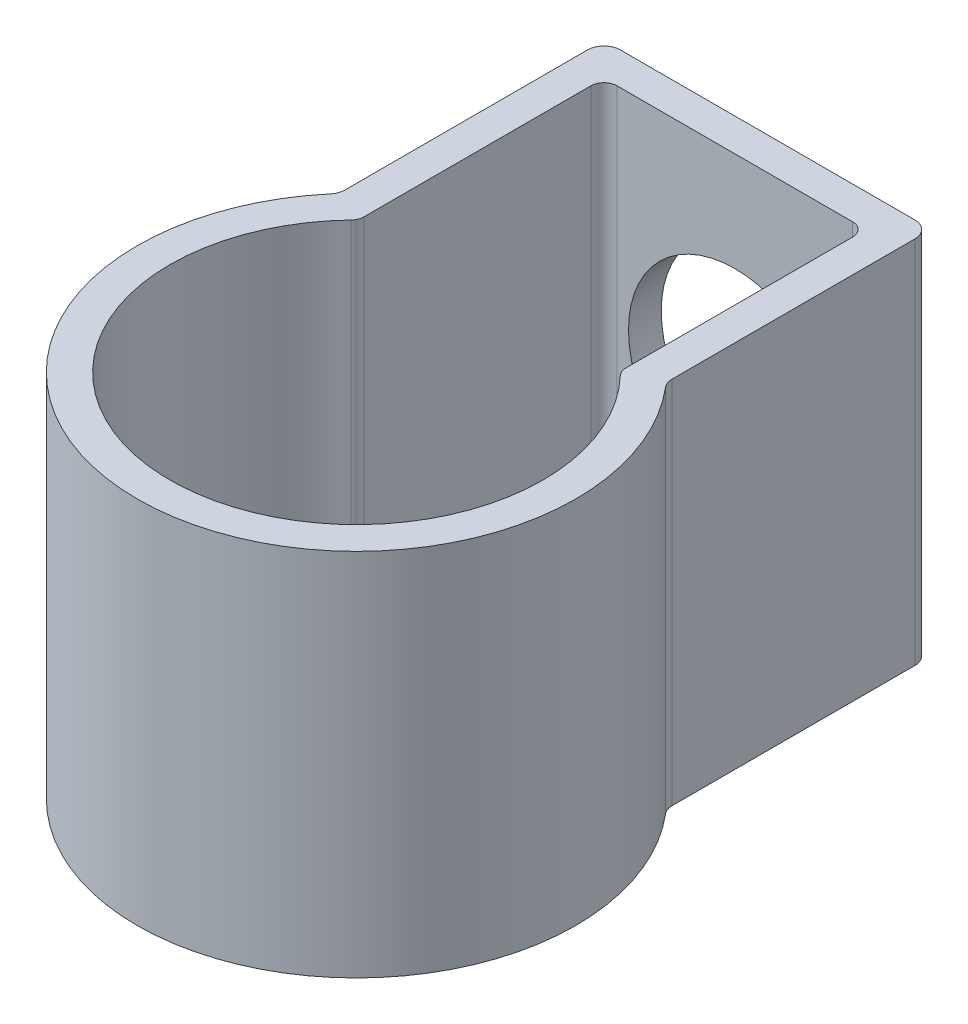
ISO-10303-21;
HEADER;
FILE_DESCRIPTION(('STEP AP214'),'2;1');
FILE_NAME('part.step','',(''),(''),'','','');
FILE_SCHEMA(('AUTOMOTIVE_DESIGN { 1 0 10303 214 1 1 1 1 }'));
ENDSEC;
DATA;
#1=APPLICATION_CONTEXT('core data for automotive mechanical design processes');
#2=APPLICATION_PROTOCOL_DEFINITION('international standard','automotive_design',2000,#1);
#3=PRODUCT_CONTEXT('',#1,'mechanical');
#4=PRODUCT('Part','Part','',(#3));
#5=PRODUCT_RELATED_PRODUCT_CATEGORY('part','',(#4));
#6=PRODUCT_DEFINITION_FORMATION('','',#4);
#7=PRODUCT_DEFINITION_CONTEXT('part definition',#1,'design');
#8=PRODUCT_DEFINITION('design','',#6,#7);
#9=PRODUCT_DEFINITION_SHAPE('','',#8);
#10=(LENGTH_UNIT() NAMED_UNIT(*) SI_UNIT(.MILLI.,.METRE.));
#11=(NAMED_UNIT(*) PLANE_ANGLE_UNIT() SI_UNIT($,.RADIAN.));
#12=(NAMED_UNIT(*) SI_UNIT($,.STERADIAN.) SOLID_ANGLE_UNIT());
#13=UNCERTAINTY_MEASURE_WITH_UNIT(LENGTH_MEASURE(1.E-05),#10,'distance_accuracy_value','');
#14=(GEOMETRIC_REPRESENTATION_CONTEXT(3) GLOBAL_UNCERTAINTY_ASSIGNED_CONTEXT((#13)) GLOBAL_UNIT_ASSIGNED_CONTEXT((#10,
#11,#12)) REPRESENTATION_CONTEXT('',''));
#15=CARTESIAN_POINT('',(0.,0.,0.));
#16=DIRECTION('',(0.,0.,1.));
#17=DIRECTION('',(1.,0.,0.));
#18=AXIS2_PLACEMENT_3D('',#15,#16,#17);
#19=CARTESIAN_POINT('',(10.,20.574,-25.1215762016988));
#20=DIRECTION('',(0.,0.,1.));
#21=DIRECTION('',(1.,0.,0.));
#22=AXIS2_PLACEMENT_3D('',#19,#20,#21);
#23=PLANE('',#22);
#24=CARTESIAN_POINT('',(0.,8.,-25.1215762016988));
#25=DIRECTION('',(0.,0.,1.));
#26=DIRECTION('',(1.,0.,0.));
#27=AXIS2_PLACEMENT_3D('',#24,#25,#26);
#28=CIRCLE('',#27,6.5);
#29=CARTESIAN_POINT('',(6.5,8.,-25.1215762016988));
#30=VERTEX_POINT('',#29);
#31=EDGE_CURVE('E245',#30,#30,#28,.T.);
#32=ORIENTED_EDGE('',*,*,#31,.T.);
#33=EDGE_LOOP('',(#32));
#34=FACE_BOUND('',#33,.T.);
#35=DIRECTION('',(1.,0.,0.));
#36=VECTOR('',#35,1.);
#37=CARTESIAN_POINT('',(-3.,-1.5,-25.1215762016988));
#38=LINE('',#37,#36);
#39=CARTESIAN_POINT('',(-3.20000000000001,-1.5,-25.1215762016988));
#40=VERTEX_POINT('',#39);
#41=CARTESIAN_POINT('',(3.19999999999999,-1.5,-25.1215762016988));
#42=VERTEX_POINT('',#41);
#43=EDGE_CURVE('E344',#40,#42,#38,.T.);
#44=ORIENTED_EDGE('',*,*,#43,.F.);
#45=DIRECTION('',(0.,1.,0.));
#46=VECTOR('',#45,1.);
#47=CARTESIAN_POINT('',(-3.2,-2.,-25.1215762016988));
#48=LINE('',#47,#46);
#49=CARTESIAN_POINT('',(-3.20000000000001,-2.,-25.1215762016988));
#50=VERTEX_POINT('',#49);
#51=EDGE_CURVE('E303',#40,#50,#48,.F.);
#52=ORIENTED_EDGE('',*,*,#51,.T.);
#53=DIRECTION('',(1.,0.,0.));
#54=VECTOR('',#53,1.);
#55=CARTESIAN_POINT('',(10.,-2.,-25.1215762016988));
#56=LINE('',#55,#54);
#57=CARTESIAN_POINT('',(-9.,-2.,-25.1215762016988));
#58=VERTEX_POINT('',#57);
#59=EDGE_CURVE('E531',#58,#50,#56,.T.);
#60=ORIENTED_EDGE('',*,*,#59,.F.);
#61=DIRECTION('',(0.,-1.,0.));
#62=VECTOR('',#61,1.);
#63=CARTESIAN_POINT('',(-9.,20.574,-25.1215762016988));
#64=LINE('',#63,#62);
#65=CARTESIAN_POINT('',(-9.,20.574,-25.1215762016988));
#66=VERTEX_POINT('',#65);
#67=EDGE_CURVE('E277',#58,#66,#64,.F.);
#68=ORIENTED_EDGE('',*,*,#67,.T.);
#69=DIRECTION('',(-1.,0.,0.));
#70=VECTOR('',#69,1.);
#71=CARTESIAN_POINT('',(10.,20.574,-25.1215762016988));
#72=LINE('',#71,#70);
#73=CARTESIAN_POINT('',(9.,20.574,-25.1215762016988));
#74=VERTEX_POINT('',#73);
#75=EDGE_CURVE('E257',#74,#66,#72,.T.);
#76=ORIENTED_EDGE('',*,*,#75,.F.);
#77=DIRECTION('',(0.,-1.,0.));
#78=VECTOR('',#77,1.);
#79=CARTESIAN_POINT('',(9.,20.574,-25.1215762016988));
#80=LINE('',#79,#78);
#81=CARTESIAN_POINT('',(9.,-2.,-25.1215762016988));
#82=VERTEX_POINT('',#81);
#83=EDGE_CURVE('E273',#74,#82,#80,.T.);
#84=ORIENTED_EDGE('',*,*,#83,.T.);
#85=CARTESIAN_POINT('',(3.2,-2.,-25.1215762016988));
#86=VERTEX_POINT('',#85);
#87=EDGE_CURVE('E528',#86,#82,#56,.T.);
#88=ORIENTED_EDGE('',*,*,#87,.F.);
#89=DIRECTION('',(0.,-1.,0.));
#90=VECTOR('',#89,1.);
#91=CARTESIAN_POINT('',(3.2,-1.5,-25.1215762016988));
#92=LINE('',#91,#90);
#93=EDGE_CURVE('E299',#86,#42,#92,.F.);
#94=ORIENTED_EDGE('',*,*,#93,.T.);
#95=EDGE_LOOP('',(#44,#52,#60,#68,#76,#84,#88,#94));
#96=FACE_BOUND('',#95,.T.);
#97=ADVANCED_FACE('F44',(#34,#96),#23,.F.);
#98=CARTESIAN_POINT('',(0.,20.574,0.));
#99=DIRECTION('',(0.,1.,0.));
#100=DIRECTION('',(0.,0.,1.));
#101=AXIS2_PLACEMENT_3D('',#98,#99,#100);
#102=PLANE('',#101);
#103=ORIENTED_EDGE('',*,*,#75,.T.);
#104=CARTESIAN_POINT('',(-9.,20.574,-24.1215762016988));
#105=DIRECTION('',(0.,1.,0.));
#106=DIRECTION('',(0.,0.,1.));
#107=AXIS2_PLACEMENT_3D('',#104,#105,#106);
#108=CIRCLE('',#107,1.);
#109=CARTESIAN_POINT('',(-10.,20.574,-24.1215762016988));
#110=VERTEX_POINT('',#109);
#111=EDGE_CURVE('E283',#66,#110,#108,.T.);
#112=ORIENTED_EDGE('',*,*,#111,.T.);
#113=DIRECTION('',(0.,0.,1.));
#114=VECTOR('',#113,1.);
#115=CARTESIAN_POINT('',(-10.,20.574,-25.1215762016988));
#116=LINE('',#115,#114);
#117=CARTESIAN_POINT('',(-10.,20.574,-9.29300812439122));
#118=VERTEX_POINT('',#117);
#119=EDGE_CURVE('E250',#110,#118,#116,.T.);
#120=ORIENTED_EDGE('',*,*,#119,.T.);
#121=CARTESIAN_POINT('',(-11.,20.574,-9.29300812439122));
#122=DIRECTION('',(0.,1.,0.));
#123=DIRECTION('',(0.,0.,1.));
#124=AXIS2_PLACEMENT_3D('',#121,#122,#123);
#125=CIRCLE('',#124,1.);
#126=CARTESIAN_POINT('',(-10.2361111111111,20.574,-8.64766033797517));
#127=VERTEX_POINT('',#126);
#128=EDGE_CURVE('E233',#118,#127,#125,.F.);
#129=ORIENTED_EDGE('',*,*,#128,.T.);
#130=CARTESIAN_POINT('',(0.,20.574,0.));
#131=DIRECTION('',(0.,1.,0.));
#132=DIRECTION('',(0.,0.,1.));
#133=AXIS2_PLACEMENT_3D('',#130,#131,#132);
#134=CIRCLE('',#133,13.4);
#135=CARTESIAN_POINT('',(10.2361111111111,20.574,-8.64766033797516));
#136=VERTEX_POINT('',#135);
#137=EDGE_CURVE('E502',#127,#136,#134,.T.);
#138=ORIENTED_EDGE('',*,*,#137,.T.);
#139=CARTESIAN_POINT('',(11.,20.574,-9.29300812439122));
#140=DIRECTION('',(0.,1.,0.));
#141=DIRECTION('',(0.,0.,1.));
#142=AXIS2_PLACEMENT_3D('',#139,#140,#141);
#143=CIRCLE('',#142,1.);
#144=CARTESIAN_POINT('',(10.,20.574,-9.29300812439122));
#145=VERTEX_POINT('',#144);
#146=EDGE_CURVE('E232',#136,#145,#143,.F.);
#147=ORIENTED_EDGE('',*,*,#146,.T.);
#148=DIRECTION('',(0.,0.,-1.));
#149=VECTOR('',#148,1.);
#150=CARTESIAN_POINT('',(10.,20.574,-8.91964124839117));
#151=LINE('',#150,#149);
#152=CARTESIAN_POINT('',(10.,20.574,-24.1215762016988));
#153=VERTEX_POINT('',#152);
#154=EDGE_CURVE('E505',#145,#153,#151,.T.);
#155=ORIENTED_EDGE('',*,*,#154,.T.);
#156=CARTESIAN_POINT('',(9.,20.574,-24.1215762016988));
#157=DIRECTION('',(0.,1.,0.));
#158=DIRECTION('',(0.,0.,1.));
#159=AXIS2_PLACEMENT_3D('',#156,#157,#158);
#160=CIRCLE('',#159,1.);
#161=EDGE_CURVE('E280',#153,#74,#160,.T.);
#162=ORIENTED_EDGE('',*,*,#161,.T.);
#163=EDGE_LOOP('',(#103,#112,#120,#129,#138,#147,#155,#162));
#164=FACE_BOUND('',#163,.T.);
#165=DIRECTION('',(0.,0.,-1.));
#166=VECTOR('',#165,1.);
#167=CARTESIAN_POINT('',(8.,20.574,-8.12157620169878));
#168=LINE('',#167,#166);
#169=CARTESIAN_POINT('',(8.,20.574,-8.44985206971104));
#170=VERTEX_POINT('',#169);
#171=CARTESIAN_POINT('',(8.,20.574,-22.3215762016988));
#172=VERTEX_POINT('',#171);
#173=EDGE_CURVE('E493',#170,#172,#168,.T.);
#174=ORIENTED_EDGE('',*,*,#173,.F.);
#175=CARTESIAN_POINT('',(8.8,20.574,-8.44985206971104));
#176=DIRECTION('',(0.,1.,0.));
#177=DIRECTION('',(0.,0.,1.));
#178=AXIS2_PLACEMENT_3D('',#175,#176,#177);
#179=CIRCLE('',#178,0.8);
#180=CARTESIAN_POINT('',(8.22295081967213,20.574,-7.89576340940212));
#181=VERTEX_POINT('',#180);
#182=EDGE_CURVE('E378',#170,#181,#179,.T.);
#183=ORIENTED_EDGE('',*,*,#182,.T.);
#184=CARTESIAN_POINT('',(0.,20.574,0.));
#185=DIRECTION('',(0.,1.,0.));
#186=DIRECTION('',(0.,0.,1.));
#187=AXIS2_PLACEMENT_3D('',#184,#185,#186);
#188=CIRCLE('',#187,11.4);
#189=CARTESIAN_POINT('',(-8.22295081967213,20.574,-7.89576340940212));
#190=VERTEX_POINT('',#189);
#191=EDGE_CURVE('E485',#190,#181,#188,.T.);
#192=ORIENTED_EDGE('',*,*,#191,.F.);
#193=CARTESIAN_POINT('',(-8.8,20.574,-8.44985206971104));
#194=DIRECTION('',(0.,1.,0.));
#195=DIRECTION('',(0.,0.,1.));
#196=AXIS2_PLACEMENT_3D('',#193,#194,#195);
#197=CIRCLE('',#196,0.8);
#198=CARTESIAN_POINT('',(-8.,20.574,-8.44985206971104));
#199=VERTEX_POINT('',#198);
#200=EDGE_CURVE('E375',#190,#199,#197,.T.);
#201=ORIENTED_EDGE('',*,*,#200,.T.);
#202=DIRECTION('',(0.,0.,1.));
#203=VECTOR('',#202,1.);
#204=CARTESIAN_POINT('',(-8.,20.574,-23.1215762016988));
#205=LINE('',#204,#203);
#206=CARTESIAN_POINT('',(-8.,20.574,-22.3215762016988));
#207=VERTEX_POINT('',#206);
#208=EDGE_CURVE('E483',#207,#199,#205,.T.);
#209=ORIENTED_EDGE('',*,*,#208,.F.);
#210=CARTESIAN_POINT('',(-7.2,20.574,-22.3215762016988));
#211=DIRECTION('',(0.,1.,0.));
#212=DIRECTION('',(0.,0.,1.));
#213=AXIS2_PLACEMENT_3D('',#210,#211,#212);
#214=CIRCLE('',#213,0.8);
#215=CARTESIAN_POINT('',(-7.2,20.574,-23.1215762016988));
#216=VERTEX_POINT('',#215);
#217=EDGE_CURVE('E384',#207,#216,#214,.F.);
#218=ORIENTED_EDGE('',*,*,#217,.T.);
#219=DIRECTION('',(-1.,0.,0.));
#220=VECTOR('',#219,1.);
#221=CARTESIAN_POINT('',(8.,20.574,-23.1215762016988));
#222=LINE('',#221,#220);
#223=CARTESIAN_POINT('',(7.2,20.574,-23.1215762016988));
#224=VERTEX_POINT('',#223);
#225=EDGE_CURVE('E489',#224,#216,#222,.T.);
#226=ORIENTED_EDGE('',*,*,#225,.F.);
#227=CARTESIAN_POINT('',(7.2,20.574,-22.3215762016988));
#228=DIRECTION('',(0.,1.,0.));
#229=DIRECTION('',(0.,0.,1.));
#230=AXIS2_PLACEMENT_3D('',#227,#228,#229);
#231=CIRCLE('',#230,0.8);
#232=EDGE_CURVE('E381',#224,#172,#231,.F.);
#233=ORIENTED_EDGE('',*,*,#232,.T.);
#234=EDGE_LOOP('',(#174,#183,#192,#201,#209,#218,#226,#233));
#235=FACE_BOUND('',#234,.T.);
#236=ADVANCED_FACE('F482',(#164,#235),#102,.T.);
#237=CARTESIAN_POINT('',(0.,20.574,0.));
#238=DIRECTION('',(0.,-1.,0.));
#239=DIRECTION('',(0.,0.,-1.));
#240=AXIS2_PLACEMENT_3D('',#237,#238,#239);
#241=CYLINDRICAL_SURFACE('',#240,13.4);
#242=ORIENTED_EDGE('',*,*,#137,.F.);
#243=DIRECTION('',(0.,-1.,0.));
#244=VECTOR('',#243,1.);
#245=CARTESIAN_POINT('',(-10.2361111111111,20.574,-8.64766033797517));
#246=LINE('',#245,#244);
#247=CARTESIAN_POINT('',(-10.2361111111111,-2.,-8.64766033797517));
#248=VERTEX_POINT('',#247);
#249=EDGE_CURVE('E242',#127,#248,#246,.T.);
#250=ORIENTED_EDGE('',*,*,#249,.T.);
#251=CARTESIAN_POINT('',(0.,-2.,0.));
#252=DIRECTION('',(0.,-1.,0.));
#253=DIRECTION('',(0.,0.,-1.));
#254=AXIS2_PLACEMENT_3D('',#251,#252,#253);
#255=CIRCLE('',#254,13.4);
#256=CARTESIAN_POINT('',(10.2361111111111,-2.,-8.64766033797516));
#257=VERTEX_POINT('',#256);
#258=EDGE_CURVE('E224',#257,#248,#255,.T.);
#259=ORIENTED_EDGE('',*,*,#258,.F.);
#260=DIRECTION('',(0.,-1.,0.));
#261=VECTOR('',#260,1.);
#262=CARTESIAN_POINT('',(10.2361111111111,20.574,-8.64766033797516));
#263=LINE('',#262,#261);
#264=EDGE_CURVE('E239',#257,#136,#263,.F.);
#265=ORIENTED_EDGE('',*,*,#264,.T.);
#266=EDGE_LOOP('',(#242,#250,#259,#265));
#267=FACE_BOUND('',#266,.T.);
#268=ADVANCED_FACE('F238',(#267),#241,.T.);
#269=CARTESIAN_POINT('',(10.,20.574,-8.91964124839117));
#270=DIRECTION('',(-1.,0.,0.));
#271=DIRECTION('',(0.,0.,1.));
#272=AXIS2_PLACEMENT_3D('',#269,#270,#271);
#273=PLANE('',#272);
#274=DIRECTION('',(0.,0.,1.));
#275=VECTOR('',#274,1.);
#276=CARTESIAN_POINT('',(10.,-2.,-8.91964124839117));
#277=LINE('',#276,#275);
#278=CARTESIAN_POINT('',(10.,-2.,-24.1215762016988));
#279=VERTEX_POINT('',#278);
#280=CARTESIAN_POINT('',(10.,-2.,-9.29300812439122));
#281=VERTEX_POINT('',#280);
#282=EDGE_CURVE('E226',#279,#281,#277,.T.);
#283=ORIENTED_EDGE('',*,*,#282,.F.);
#284=DIRECTION('',(0.,-1.,0.));
#285=VECTOR('',#284,1.);
#286=CARTESIAN_POINT('',(10.,20.574,-24.1215762016988));
#287=LINE('',#286,#285);
#288=EDGE_CURVE('E289',#279,#153,#287,.F.);
#289=ORIENTED_EDGE('',*,*,#288,.T.);
#290=ORIENTED_EDGE('',*,*,#154,.F.);
#291=DIRECTION('',(0.,1.,0.));
#292=VECTOR('',#291,1.);
#293=CARTESIAN_POINT('',(10.,-2.,-9.29300812439122));
#294=LINE('',#293,#292);
#295=EDGE_CURVE('E286',#145,#281,#294,.F.);
#296=ORIENTED_EDGE('',*,*,#295,.T.);
#297=EDGE_LOOP('',(#283,#289,#290,#296));
#298=FACE_BOUND('',#297,.T.);
#299=ADVANCED_FACE('F636',(#298),#273,.F.);
#300=CARTESIAN_POINT('',(-10.,20.574,-25.1215762016988));
#301=DIRECTION('',(1.,0.,0.));
#302=DIRECTION('',(0.,0.,-1.));
#303=AXIS2_PLACEMENT_3D('',#300,#301,#302);
#304=PLANE('',#303);
#305=DIRECTION('',(0.,0.,-1.));
#306=VECTOR('',#305,1.);
#307=CARTESIAN_POINT('',(-10.,-2.,-25.1215762016988));
#308=LINE('',#307,#306);
#309=CARTESIAN_POINT('',(-10.,-2.,-9.29300812439122));
#310=VERTEX_POINT('',#309);
#311=CARTESIAN_POINT('',(-10.,-2.,-24.1215762016988));
#312=VERTEX_POINT('',#311);
#313=EDGE_CURVE('E244',#310,#312,#308,.T.);
#314=ORIENTED_EDGE('',*,*,#313,.F.);
#315=DIRECTION('',(0.,1.,0.));
#316=VECTOR('',#315,1.);
#317=CARTESIAN_POINT('',(-10.,20.574,-9.29300812439122));
#318=LINE('',#317,#316);
#319=EDGE_CURVE('E264',#310,#118,#318,.T.);
#320=ORIENTED_EDGE('',*,*,#319,.T.);
#321=ORIENTED_EDGE('',*,*,#119,.F.);
#322=DIRECTION('',(0.,-1.,0.));
#323=VECTOR('',#322,1.);
#324=CARTESIAN_POINT('',(-10.,20.574,-24.1215762016988));
#325=LINE('',#324,#323);
#326=EDGE_CURVE('E254',#110,#312,#325,.T.);
#327=ORIENTED_EDGE('',*,*,#326,.T.);
#328=EDGE_LOOP('',(#314,#320,#321,#327));
#329=FACE_BOUND('',#328,.T.);
#330=ADVANCED_FACE('F524',(#329),#304,.F.);
#331=CARTESIAN_POINT('',(8.,20.574,-23.1215762016988));
#332=DIRECTION('',(0.,0.,1.));
#333=DIRECTION('',(1.,0.,0.));
#334=AXIS2_PLACEMENT_3D('',#331,#332,#333);
#335=PLANE('',#334);
#336=CARTESIAN_POINT('',(0.,8.,-23.1215762016988));
#337=DIRECTION('',(0.,0.,1.));
#338=DIRECTION('',(1.,0.,0.));
#339=AXIS2_PLACEMENT_3D('',#336,#337,#338);
#340=CIRCLE('',#339,6.5);
#341=CARTESIAN_POINT('',(6.5,8.,-23.1215762016988));
#342=VERTEX_POINT('',#341);
#343=EDGE_CURVE('E555',#342,#342,#340,.T.);
#344=ORIENTED_EDGE('',*,*,#343,.F.);
#345=EDGE_LOOP('',(#344));
#346=FACE_BOUND('',#345,.T.);
#347=DIRECTION('',(0.,-1.,0.));
#348=VECTOR('',#347,1.);
#349=CARTESIAN_POINT('',(-7.2,0.,-23.1215762016988));
#350=LINE('',#349,#348);
#351=CARTESIAN_POINT('',(-7.2,0.199999999999999,-23.1215762016988));
#352=VERTEX_POINT('',#351);
#353=EDGE_CURVE('E355',#216,#352,#350,.T.);
#354=ORIENTED_EDGE('',*,*,#353,.T.);
#355=DIRECTION('',(1.,0.,0.));
#356=VECTOR('',#355,1.);
#357=CARTESIAN_POINT('',(8.,0.199999999999999,-23.1215762016988));
#358=LINE('',#357,#356);
#359=CARTESIAN_POINT('',(7.2,0.199999999999999,-23.1215762016988));
#360=VERTEX_POINT('',#359);
#361=EDGE_CURVE('E412',#352,#360,#358,.T.);
#362=ORIENTED_EDGE('',*,*,#361,.T.);
#363=DIRECTION('',(0.,-1.,0.));
#364=VECTOR('',#363,1.);
#365=CARTESIAN_POINT('',(7.2,20.574,-23.1215762016988));
#366=LINE('',#365,#364);
#367=EDGE_CURVE('E359',#360,#224,#366,.F.);
#368=ORIENTED_EDGE('',*,*,#367,.T.);
#369=ORIENTED_EDGE('',*,*,#225,.T.);
#370=EDGE_LOOP('',(#354,#362,#368,#369));
#371=FACE_BOUND('',#370,.T.);
#372=ADVANCED_FACE('F577',(#346,#371),#335,.T.);
#373=CARTESIAN_POINT('',(-8.,20.574,-23.1215762016988));
#374=DIRECTION('',(1.,0.,0.));
#375=DIRECTION('',(0.,0.,-1.));
#376=AXIS2_PLACEMENT_3D('',#373,#374,#375);
#377=PLANE('',#376);
#378=DIRECTION('',(0.,-1.,0.));
#379=VECTOR('',#378,1.);
#380=CARTESIAN_POINT('',(-8.,20.574,-8.44985206971104));
#381=LINE('',#380,#379);
#382=CARTESIAN_POINT('',(-8.,0.199999999999999,-8.44985206971104));
#383=VERTEX_POINT('',#382);
#384=EDGE_CURVE('E362',#199,#383,#381,.T.);
#385=ORIENTED_EDGE('',*,*,#384,.T.);
#386=DIRECTION('',(0.,0.,-1.));
#387=VECTOR('',#386,1.);
#388=CARTESIAN_POINT('',(-8.,0.199999999999999,-23.1215762016988));
#389=LINE('',#388,#387);
#390=CARTESIAN_POINT('',(-8.,0.199999999999999,-22.3215762016988));
#391=VERTEX_POINT('',#390);
#392=EDGE_CURVE('E11',#383,#391,#389,.T.);
#393=ORIENTED_EDGE('',*,*,#392,.T.);
#394=DIRECTION('',(0.,-1.,0.));
#395=VECTOR('',#394,1.);
#396=CARTESIAN_POINT('',(-8.,20.574,-22.3215762016988));
#397=LINE('',#396,#395);
#398=EDGE_CURVE('E365',#391,#207,#397,.F.);
#399=ORIENTED_EDGE('',*,*,#398,.T.);
#400=ORIENTED_EDGE('',*,*,#208,.T.);
#401=EDGE_LOOP('',(#385,#393,#399,#400));
#402=FACE_BOUND('',#401,.T.);
#403=ADVANCED_FACE('F486',(#402),#377,.T.);
#404=CARTESIAN_POINT('',(0.,20.574,0.));
#405=DIRECTION('',(0.,-1.,0.));
#406=DIRECTION('',(0.,0.,-1.));
#407=AXIS2_PLACEMENT_3D('',#404,#405,#406);
#408=CYLINDRICAL_SURFACE('',#407,11.4);
#409=DIRECTION('',(0.,-1.,0.));
#410=VECTOR('',#409,1.);
#411=CARTESIAN_POINT('',(8.22295081967213,20.574,-7.89576340940212));
#412=LINE('',#411,#410);
#413=CARTESIAN_POINT('',(8.22295081967213,0.199999999999999,-7.89576340940212));
#414=VERTEX_POINT('',#413);
#415=EDGE_CURVE('E371',#181,#414,#412,.T.);
#416=ORIENTED_EDGE('',*,*,#415,.T.);
#417=CARTESIAN_POINT('',(0.,0.200000000000009,0.));
#418=DIRECTION('',(0.,-1.,0.));
#419=DIRECTION('',(0.,0.,-1.));
#420=AXIS2_PLACEMENT_3D('',#417,#418,#419);
#421=CIRCLE('',#420,11.4);
#422=CARTESIAN_POINT('',(-8.22295081967213,0.199999999999999,-7.89576340940212));
#423=VERTEX_POINT('',#422);
#424=EDGE_CURVE('E419',#414,#423,#421,.T.);
#425=ORIENTED_EDGE('',*,*,#424,.T.);
#426=DIRECTION('',(0.,-1.,0.));
#427=VECTOR('',#426,1.);
#428=CARTESIAN_POINT('',(-8.22295081967213,20.574,-7.89576340940212));
#429=LINE('',#428,#427);
#430=EDGE_CURVE('E368',#423,#190,#429,.F.);
#431=ORIENTED_EDGE('',*,*,#430,.T.);
#432=ORIENTED_EDGE('',*,*,#191,.T.);
#433=EDGE_LOOP('',(#416,#425,#431,#432));
#434=FACE_BOUND('',#433,.T.);
#435=ADVANCED_FACE('F472',(#434),#408,.F.);
#436=CARTESIAN_POINT('',(8.,20.574,-8.12157620169878));
#437=DIRECTION('',(-1.,0.,0.));
#438=DIRECTION('',(0.,0.,1.));
#439=AXIS2_PLACEMENT_3D('',#436,#437,#438);
#440=PLANE('',#439);
#441=DIRECTION('',(0.,-1.,0.));
#442=VECTOR('',#441,1.);
#443=CARTESIAN_POINT('',(8.,0.,-22.3215762016988));
#444=LINE('',#443,#442);
#445=CARTESIAN_POINT('',(8.,0.199999999999999,-22.3215762016988));
#446=VERTEX_POINT('',#445);
#447=EDGE_CURVE('E351',#172,#446,#444,.T.);
#448=ORIENTED_EDGE('',*,*,#447,.T.);
#449=DIRECTION('',(0.,0.,1.));
#450=VECTOR('',#449,1.);
#451=CARTESIAN_POINT('',(8.,0.199999999999999,-8.12157620169878));
#452=LINE('',#451,#450);
#453=CARTESIAN_POINT('',(8.,0.199999999999999,-8.44985206971104));
#454=VERTEX_POINT('',#453);
#455=EDGE_CURVE('E416',#446,#454,#452,.T.);
#456=ORIENTED_EDGE('',*,*,#455,.T.);
#457=DIRECTION('',(0.,-1.,0.));
#458=VECTOR('',#457,1.);
#459=CARTESIAN_POINT('',(8.,20.574,-8.44985206971104));
#460=LINE('',#459,#458);
#461=EDGE_CURVE('E339',#454,#170,#460,.F.);
#462=ORIENTED_EDGE('',*,*,#461,.T.);
#463=ORIENTED_EDGE('',*,*,#173,.T.);
#464=EDGE_LOOP('',(#448,#456,#462,#463));
#465=FACE_BOUND('',#464,.T.);
#466=ADVANCED_FACE('F611',(#465),#440,.T.);
#467=CARTESIAN_POINT('',(0.,0.,0.));
#468=DIRECTION('',(0.,-1.,0.));
#469=DIRECTION('',(0.,0.,-1.));
#470=AXIS2_PLACEMENT_3D('',#467,#468,#469);
#471=PLANE('',#470);
#472=CARTESIAN_POINT('',(8.8,0.,-8.44985206971104));
#473=DIRECTION('',(0.,-1.,0.));
#474=DIRECTION('',(0.,0.,-1.));
#475=AXIS2_PLACEMENT_3D('',#472,#473,#474);
#476=CIRCLE('',#475,1.00000000000001);
#477=CARTESIAN_POINT('',(8.07868852459015,0.,-7.75724124432488));
#478=VERTEX_POINT('',#477);
#479=CARTESIAN_POINT('',(7.79999999999999,0.,-8.44985206971104));
#480=VERTEX_POINT('',#479);
#481=EDGE_CURVE('E403',#478,#480,#476,.T.);
#482=ORIENTED_EDGE('',*,*,#481,.T.);
#483=DIRECTION('',(0.,0.,-1.));
#484=VECTOR('',#483,1.);
#485=CARTESIAN_POINT('',(7.79999999999999,0.,0.));
#486=LINE('',#485,#484);
#487=CARTESIAN_POINT('',(7.79999999999999,0.,-22.3215762016988));
#488=VERTEX_POINT('',#487);
#489=EDGE_CURVE('E409',#480,#488,#486,.T.);
#490=ORIENTED_EDGE('',*,*,#489,.T.);
#491=CARTESIAN_POINT('',(7.2,0.,-22.3215762016988));
#492=DIRECTION('',(0.,-1.,0.));
#493=DIRECTION('',(0.,0.,-1.));
#494=AXIS2_PLACEMENT_3D('',#491,#492,#493);
#495=CIRCLE('',#494,0.599999999999993);
#496=CARTESIAN_POINT('',(7.2,0.,-22.9215762016988));
#497=VERTEX_POINT('',#496);
#498=EDGE_CURVE('E406',#488,#497,#495,.F.);
#499=ORIENTED_EDGE('',*,*,#498,.T.);
#500=DIRECTION('',(-1.,0.,0.));
#501=VECTOR('',#500,1.);
#502=CARTESIAN_POINT('',(0.,0.,-22.9215762016988));
#503=LINE('',#502,#501);
#504=CARTESIAN_POINT('',(-7.2,0.,-22.9215762016988));
#505=VERTEX_POINT('',#504);
#506=EDGE_CURVE('E399',#497,#505,#503,.T.);
#507=ORIENTED_EDGE('',*,*,#506,.T.);
#508=CARTESIAN_POINT('',(-7.2,0.,-22.3215762016988));
#509=DIRECTION('',(0.,-1.,0.));
#510=DIRECTION('',(0.,0.,-1.));
#511=AXIS2_PLACEMENT_3D('',#508,#509,#510);
#512=CIRCLE('',#511,0.599999999999995);
#513=CARTESIAN_POINT('',(-7.79999999999999,0.,-22.3215762016988));
#514=VERTEX_POINT('',#513);
#515=EDGE_CURVE('E393',#505,#514,#512,.F.);
#516=ORIENTED_EDGE('',*,*,#515,.T.);
#517=DIRECTION('',(0.,0.,1.));
#518=VECTOR('',#517,1.);
#519=CARTESIAN_POINT('',(-7.79999999999999,0.,0.));
#520=LINE('',#519,#518);
#521=CARTESIAN_POINT('',(-7.79999999999999,0.,-8.44985206971104));
#522=VERTEX_POINT('',#521);
#523=EDGE_CURVE('E387',#514,#522,#520,.T.);
#524=ORIENTED_EDGE('',*,*,#523,.T.);
#525=CARTESIAN_POINT('',(-8.8,0.,-8.44985206971104));
#526=DIRECTION('',(0.,-1.,0.));
#527=DIRECTION('',(0.,0.,-1.));
#528=AXIS2_PLACEMENT_3D('',#525,#526,#527);
#529=CIRCLE('',#528,1.00000000000001);
#530=CARTESIAN_POINT('',(-8.07868852459016,0.,-7.75724124432489));
#531=VERTEX_POINT('',#530);
#532=EDGE_CURVE('E390',#522,#531,#529,.T.);
#533=ORIENTED_EDGE('',*,*,#532,.T.);
#534=CARTESIAN_POINT('',(0.,0.,0.));
#535=DIRECTION('',(0.,-1.,0.));
#536=DIRECTION('',(0.,0.,-1.));
#537=AXIS2_PLACEMENT_3D('',#534,#535,#536);
#538=CIRCLE('',#537,11.1999999999999);
#539=EDGE_CURVE('E396',#531,#478,#538,.F.);
#540=ORIENTED_EDGE('',*,*,#539,.T.);
#541=EDGE_LOOP('',(#482,#490,#499,#507,#516,#524,#533,#540));
#542=FACE_BOUND('',#541,.T.);
#543=ADVANCED_FACE('F599',(#542),#471,.F.);
#544=CARTESIAN_POINT('',(0.,-2.,0.));
#545=DIRECTION('',(0.,-1.,0.));
#546=DIRECTION('',(0.,0.,-1.));
#547=AXIS2_PLACEMENT_3D('',#544,#545,#546);
#548=PLANE('',#547);
#549=ORIENTED_EDGE('',*,*,#59,.T.);
#550=CARTESIAN_POINT('',(-3.2,-2.,-25.3215762016988));
#551=DIRECTION('',(0.,-1.,0.));
#552=DIRECTION('',(0.,0.,-1.));
#553=AXIS2_PLACEMENT_3D('',#550,#551,#552);
#554=CIRCLE('',#553,0.2);
#555=CARTESIAN_POINT('',(-3.,-2.,-25.3215762016988));
#556=VERTEX_POINT('',#555);
#557=EDGE_CURVE('E330',#50,#556,#554,.F.);
#558=ORIENTED_EDGE('',*,*,#557,.T.);
#559=CARTESIAN_POINT('',(-2.8,-2.,-25.3215762016988));
#560=DIRECTION('',(0.,-1.,0.));
#561=DIRECTION('',(0.,0.,-1.));
#562=AXIS2_PLACEMENT_3D('',#559,#560,#561);
#563=CIRCLE('',#562,0.2);
#564=CARTESIAN_POINT('',(-2.8,-2.,-25.5215762016988));
#565=VERTEX_POINT('',#564);
#566=EDGE_CURVE('E323',#556,#565,#563,.T.);
#567=ORIENTED_EDGE('',*,*,#566,.T.);
#568=DIRECTION('',(-1.,0.,0.));
#569=VECTOR('',#568,1.);
#570=CARTESIAN_POINT('',(-3.,-2.,-25.5215762016988));
#571=LINE('',#570,#569);
#572=CARTESIAN_POINT('',(2.8,-2.,-25.5215762016988));
#573=VERTEX_POINT('',#572);
#574=EDGE_CURVE('E548',#573,#565,#571,.T.);
#575=ORIENTED_EDGE('',*,*,#574,.F.);
#576=CARTESIAN_POINT('',(2.8,-2.,-25.3215762016988));
#577=DIRECTION('',(0.,-1.,0.));
#578=DIRECTION('',(0.,0.,-1.));
#579=AXIS2_PLACEMENT_3D('',#576,#577,#578);
#580=CIRCLE('',#579,0.2);
#581=CARTESIAN_POINT('',(3.,-2.,-25.3215762016988));
#582=VERTEX_POINT('',#581);
#583=EDGE_CURVE('E320',#573,#582,#580,.T.);
#584=ORIENTED_EDGE('',*,*,#583,.T.);
#585=CARTESIAN_POINT('',(3.2,-2.,-25.3215762016988));
#586=DIRECTION('',(0.,-1.,0.));
#587=DIRECTION('',(0.,0.,-1.));
#588=AXIS2_PLACEMENT_3D('',#585,#586,#587);
#589=CIRCLE('',#588,0.2);
#590=EDGE_CURVE('E333',#582,#86,#589,.F.);
#591=ORIENTED_EDGE('',*,*,#590,.T.);
#592=ORIENTED_EDGE('',*,*,#87,.T.);
#593=CARTESIAN_POINT('',(9.,-2.,-24.1215762016988));
#594=DIRECTION('',(0.,-1.,0.));
#595=DIRECTION('',(0.,0.,-1.));
#596=AXIS2_PLACEMENT_3D('',#593,#594,#595);
#597=CIRCLE('',#596,1.);
#598=EDGE_CURVE('E267',#82,#279,#597,.T.);
#599=ORIENTED_EDGE('',*,*,#598,.T.);
#600=ORIENTED_EDGE('',*,*,#282,.T.);
#601=CARTESIAN_POINT('',(11.,-2.,-9.29300812439122));
#602=DIRECTION('',(0.,-1.,0.));
#603=DIRECTION('',(0.,0.,-1.));
#604=AXIS2_PLACEMENT_3D('',#601,#602,#603);
#605=CIRCLE('',#604,1.);
#606=EDGE_CURVE('E220',#281,#257,#605,.F.);
#607=ORIENTED_EDGE('',*,*,#606,.T.);
#608=ORIENTED_EDGE('',*,*,#258,.T.);
#609=CARTESIAN_POINT('',(-11.,-2.,-9.29300812439122));
#610=DIRECTION('',(0.,-1.,0.));
#611=DIRECTION('',(0.,0.,-1.));
#612=AXIS2_PLACEMENT_3D('',#609,#610,#611);
#613=CIRCLE('',#612,1.);
#614=EDGE_CURVE('E292',#248,#310,#613,.F.);
#615=ORIENTED_EDGE('',*,*,#614,.T.);
#616=ORIENTED_EDGE('',*,*,#313,.T.);
#617=CARTESIAN_POINT('',(-9.,-2.,-24.1215762016988));
#618=DIRECTION('',(0.,-1.,0.));
#619=DIRECTION('',(0.,0.,-1.));
#620=AXIS2_PLACEMENT_3D('',#617,#618,#619);
#621=CIRCLE('',#620,1.);
#622=EDGE_CURVE('E270',#312,#58,#621,.T.);
#623=ORIENTED_EDGE('',*,*,#622,.T.);
#624=EDGE_LOOP('',(#549,#558,#567,#575,#584,#591,#592,#599,#600,#607,#608,#615,#616,#623));
#625=FACE_BOUND('',#624,.T.);
#626=ADVANCED_FACE('F223',(#625),#548,.T.);
#627=CARTESIAN_POINT('',(0.,8.,-25.1215762016988));
#628=DIRECTION('',(0.,0.,1.));
#629=DIRECTION('',(1.,0.,0.));
#630=AXIS2_PLACEMENT_3D('',#627,#628,#629);
#631=CYLINDRICAL_SURFACE('',#630,6.5);
#632=ORIENTED_EDGE('',*,*,#31,.F.);
#633=EDGE_LOOP('',(#632));
#634=FACE_BOUND('',#633,.T.);
#635=ORIENTED_EDGE('',*,*,#343,.T.);
#636=EDGE_LOOP('',(#635));
#637=FACE_BOUND('',#636,.T.);
#638=ADVANCED_FACE('F570',(#634,#637),#631,.F.);
#639=CARTESIAN_POINT('',(-11.,20.574,-9.29300812439122));
#640=DIRECTION('',(0.,-1.,0.));
#641=DIRECTION('',(0.,0.,-1.));
#642=AXIS2_PLACEMENT_3D('',#639,#640,#641);
#643=CYLINDRICAL_SURFACE('',#642,1.);
#644=ORIENTED_EDGE('',*,*,#128,.F.);
#645=ORIENTED_EDGE('',*,*,#319,.F.);
#646=ORIENTED_EDGE('',*,*,#614,.F.);
#647=ORIENTED_EDGE('',*,*,#249,.F.);
#648=EDGE_LOOP('',(#644,#645,#646,#647));
#649=FACE_BOUND('',#648,.T.);
#650=ADVANCED_FACE('F573',(#649),#643,.F.);
#651=CARTESIAN_POINT('',(-9.,20.574,-24.1215762016988));
#652=DIRECTION('',(0.,-1.,0.));
#653=DIRECTION('',(0.,0.,-1.));
#654=AXIS2_PLACEMENT_3D('',#651,#652,#653);
#655=CYLINDRICAL_SURFACE('',#654,1.);
#656=ORIENTED_EDGE('',*,*,#111,.F.);
#657=ORIENTED_EDGE('',*,*,#67,.F.);
#658=ORIENTED_EDGE('',*,*,#622,.F.);
#659=ORIENTED_EDGE('',*,*,#326,.F.);
#660=EDGE_LOOP('',(#656,#657,#658,#659));
#661=FACE_BOUND('',#660,.T.);
#662=ADVANCED_FACE('F520',(#661),#655,.T.);
#663=CARTESIAN_POINT('',(9.,20.574,-24.1215762016988));
#664=DIRECTION('',(0.,-1.,0.));
#665=DIRECTION('',(0.,0.,-1.));
#666=AXIS2_PLACEMENT_3D('',#663,#664,#665);
#667=CYLINDRICAL_SURFACE('',#666,1.);
#668=ORIENTED_EDGE('',*,*,#161,.F.);
#669=ORIENTED_EDGE('',*,*,#288,.F.);
#670=ORIENTED_EDGE('',*,*,#598,.F.);
#671=ORIENTED_EDGE('',*,*,#83,.F.);
#672=EDGE_LOOP('',(#668,#669,#670,#671));
#673=FACE_BOUND('',#672,.T.);
#674=ADVANCED_FACE('F647',(#673),#667,.T.);
#675=CARTESIAN_POINT('',(11.,20.574,-9.29300812439122));
#676=DIRECTION('',(0.,-1.,0.));
#677=DIRECTION('',(0.,0.,-1.));
#678=AXIS2_PLACEMENT_3D('',#675,#676,#677);
#679=CYLINDRICAL_SURFACE('',#678,1.);
#680=ORIENTED_EDGE('',*,*,#146,.F.);
#681=ORIENTED_EDGE('',*,*,#264,.F.);
#682=ORIENTED_EDGE('',*,*,#606,.F.);
#683=ORIENTED_EDGE('',*,*,#295,.F.);
#684=EDGE_LOOP('',(#680,#681,#682,#683));
#685=FACE_BOUND('',#684,.T.);
#686=ADVANCED_FACE('F248',(#685),#679,.F.);
#687=CARTESIAN_POINT('',(-3.,-1.5,-25.5215762016988));
#688=DIRECTION('',(0.,-1.,0.));
#689=DIRECTION('',(0.,0.,-1.));
#690=AXIS2_PLACEMENT_3D('',#687,#688,#689);
#691=PLANE('',#690);
#692=DIRECTION('',(1.,0.,0.));
#693=VECTOR('',#692,1.);
#694=CARTESIAN_POINT('',(-3.,-1.5,-25.5215762016988));
#695=LINE('',#694,#693);
#696=CARTESIAN_POINT('',(-2.8,-1.5,-25.5215762016988));
#697=VERTEX_POINT('',#696);
#698=CARTESIAN_POINT('',(2.79999999999999,-1.5,-25.5215762016988));
#699=VERTEX_POINT('',#698);
#700=EDGE_CURVE('E556',#697,#699,#695,.T.);
#701=ORIENTED_EDGE('',*,*,#700,.F.);
#702=CARTESIAN_POINT('',(-2.8,-1.5,-25.3215762016988));
#703=DIRECTION('',(0.,-1.,0.));
#704=DIRECTION('',(0.,0.,-1.));
#705=AXIS2_PLACEMENT_3D('',#702,#703,#704);
#706=CIRCLE('',#705,0.2);
#707=CARTESIAN_POINT('',(-3.,-1.5,-25.3215762016988));
#708=VERTEX_POINT('',#707);
#709=EDGE_CURVE('E317',#697,#708,#706,.F.);
#710=ORIENTED_EDGE('',*,*,#709,.T.);
#711=CARTESIAN_POINT('',(-3.20000000000001,-1.5,-25.3215762016988));
#712=DIRECTION('',(0.,-1.,0.));
#713=DIRECTION('',(0.,0.,-1.));
#714=AXIS2_PLACEMENT_3D('',#711,#712,#713);
#715=CIRCLE('',#714,0.2);
#716=EDGE_CURVE('E326',#708,#40,#715,.T.);
#717=ORIENTED_EDGE('',*,*,#716,.T.);
#718=ORIENTED_EDGE('',*,*,#43,.T.);
#719=CARTESIAN_POINT('',(3.2,-1.5,-25.3215762016988));
#720=DIRECTION('',(0.,-1.,0.));
#721=DIRECTION('',(0.,0.,-1.));
#722=AXIS2_PLACEMENT_3D('',#719,#720,#721);
#723=CIRCLE('',#722,0.2);
#724=CARTESIAN_POINT('',(3.,-1.5,-25.3215762016988));
#725=VERTEX_POINT('',#724);
#726=EDGE_CURVE('E336',#42,#725,#723,.T.);
#727=ORIENTED_EDGE('',*,*,#726,.T.);
#728=CARTESIAN_POINT('',(2.8,-1.5,-25.3215762016988));
#729=DIRECTION('',(0.,-1.,0.));
#730=DIRECTION('',(0.,0.,-1.));
#731=AXIS2_PLACEMENT_3D('',#728,#729,#730);
#732=CIRCLE('',#731,0.2);
#733=EDGE_CURVE('E314',#725,#699,#732,.F.);
#734=ORIENTED_EDGE('',*,*,#733,.T.);
#735=EDGE_LOOP('',(#701,#710,#717,#718,#727,#734));
#736=FACE_BOUND('',#735,.T.);
#737=ADVANCED_FACE('F653',(#736),#691,.F.);
#738=CARTESIAN_POINT('',(0.,0.,-25.5215762016988));
#739=DIRECTION('',(0.,0.,1.));
#740=DIRECTION('',(1.,0.,0.));
#741=AXIS2_PLACEMENT_3D('',#738,#739,#740);
#742=PLANE('',#741);
#743=ORIENTED_EDGE('',*,*,#574,.T.);
#744=DIRECTION('',(0.,1.,0.));
#745=VECTOR('',#744,1.);
#746=CARTESIAN_POINT('',(-2.80000000000001,0.,-25.5215762016988));
#747=LINE('',#746,#745);
#748=EDGE_CURVE('E311',#565,#697,#747,.T.);
#749=ORIENTED_EDGE('',*,*,#748,.T.);
#750=ORIENTED_EDGE('',*,*,#700,.T.);
#751=DIRECTION('',(0.,-1.,0.));
#752=VECTOR('',#751,1.);
#753=CARTESIAN_POINT('',(2.8,0.,-25.5215762016988));
#754=LINE('',#753,#752);
#755=EDGE_CURVE('E307',#699,#573,#754,.T.);
#756=ORIENTED_EDGE('',*,*,#755,.T.);
#757=EDGE_LOOP('',(#743,#749,#750,#756));
#758=FACE_BOUND('',#757,.T.);
#759=ADVANCED_FACE('F550',(#758),#742,.F.);
#760=CARTESIAN_POINT('',(-2.80000000000001,0.,-25.3215762016988));
#761=DIRECTION('',(0.,1.,0.));
#762=DIRECTION('',(-1.,0.,0.));
#763=AXIS2_PLACEMENT_3D('',#760,#761,#762);
#764=CYLINDRICAL_SURFACE('',#763,0.2);
#765=ORIENTED_EDGE('',*,*,#748,.F.);
#766=ORIENTED_EDGE('',*,*,#566,.F.);
#767=DIRECTION('',(0.,1.,0.));
#768=VECTOR('',#767,1.);
#769=CARTESIAN_POINT('',(-3.,-1.5,-25.3215762016988));
#770=LINE('',#769,#768);
#771=EDGE_CURVE('E340',#708,#556,#770,.F.);
#772=ORIENTED_EDGE('',*,*,#771,.F.);
#773=ORIENTED_EDGE('',*,*,#709,.F.);
#774=EDGE_LOOP('',(#765,#766,#772,#773));
#775=FACE_BOUND('',#774,.T.);
#776=ADVANCED_FACE('F545',(#775),#764,.T.);
#777=CARTESIAN_POINT('',(-3.20000000000001,-1.5,-25.3215762016988));
#778=DIRECTION('',(0.,-1.,0.));
#779=DIRECTION('',(1.,0.,0.));
#780=AXIS2_PLACEMENT_3D('',#777,#778,#779);
#781=CYLINDRICAL_SURFACE('',#780,0.2);
#782=ORIENTED_EDGE('',*,*,#557,.F.);
#783=ORIENTED_EDGE('',*,*,#51,.F.);
#784=ORIENTED_EDGE('',*,*,#716,.F.);
#785=ORIENTED_EDGE('',*,*,#771,.T.);
#786=EDGE_LOOP('',(#782,#783,#784,#785));
#787=FACE_BOUND('',#786,.T.);
#788=ADVANCED_FACE('F540',(#787),#781,.F.);
#789=CARTESIAN_POINT('',(3.2,-1.5,-25.3215762016988));
#790=DIRECTION('',(0.,1.,0.));
#791=DIRECTION('',(-1.,0.,0.));
#792=AXIS2_PLACEMENT_3D('',#789,#790,#791);
#793=CYLINDRICAL_SURFACE('',#792,0.2);
#794=DIRECTION('',(0.,-1.,0.));
#795=VECTOR('',#794,1.);
#796=CARTESIAN_POINT('',(3.,-2.,-25.3215762016988));
#797=LINE('',#796,#795);
#798=EDGE_CURVE('E345',#725,#582,#797,.T.);
#799=ORIENTED_EDGE('',*,*,#798,.F.);
#800=ORIENTED_EDGE('',*,*,#726,.F.);
#801=ORIENTED_EDGE('',*,*,#93,.F.);
#802=ORIENTED_EDGE('',*,*,#590,.F.);
#803=EDGE_LOOP('',(#799,#800,#801,#802));
#804=FACE_BOUND('',#803,.T.);
#805=ADVANCED_FACE('F656',(#804),#793,.F.);
#806=CARTESIAN_POINT('',(2.8,0.,-25.3215762016988));
#807=DIRECTION('',(0.,-1.,0.));
#808=DIRECTION('',(1.,0.,0.));
#809=AXIS2_PLACEMENT_3D('',#806,#807,#808);
#810=CYLINDRICAL_SURFACE('',#809,0.2);
#811=ORIENTED_EDGE('',*,*,#733,.F.);
#812=ORIENTED_EDGE('',*,*,#798,.T.);
#813=ORIENTED_EDGE('',*,*,#583,.F.);
#814=ORIENTED_EDGE('',*,*,#755,.F.);
#815=EDGE_LOOP('',(#811,#812,#813,#814));
#816=FACE_BOUND('',#815,.T.);
#817=ADVANCED_FACE('F659',(#816),#810,.T.);
#818=CARTESIAN_POINT('',(7.2,20.574,-22.3215762016988));
#819=DIRECTION('',(0.,1.,0.));
#820=DIRECTION('',(0.,0.,1.));
#821=AXIS2_PLACEMENT_3D('',#818,#819,#820);
#822=CYLINDRICAL_SURFACE('',#821,0.8);
#823=ORIENTED_EDGE('',*,*,#367,.F.);
#824=CARTESIAN_POINT('',(7.2,0.199999999999999,-22.3215762016988));
#825=DIRECTION('',(0.,-1.,0.));
#826=DIRECTION('',(0.,0.,-1.));
#827=AXIS2_PLACEMENT_3D('',#824,#825,#826);
#828=CIRCLE('',#827,0.8);
#829=EDGE_CURVE('E422',#360,#446,#828,.T.);
#830=ORIENTED_EDGE('',*,*,#829,.T.);
#831=ORIENTED_EDGE('',*,*,#447,.F.);
#832=ORIENTED_EDGE('',*,*,#232,.F.);
#833=EDGE_LOOP('',(#823,#830,#831,#832));
#834=FACE_BOUND('',#833,.T.);
#835=ADVANCED_FACE('F607',(#834),#822,.F.);
#836=CARTESIAN_POINT('',(-7.2,20.574,-22.3215762016988));
#837=DIRECTION('',(0.,1.,0.));
#838=DIRECTION('',(0.,0.,1.));
#839=AXIS2_PLACEMENT_3D('',#836,#837,#838);
#840=CYLINDRICAL_SURFACE('',#839,0.8);
#841=ORIENTED_EDGE('',*,*,#398,.F.);
#842=CARTESIAN_POINT('',(-7.2,0.199999999999999,-22.3215762016988));
#843=DIRECTION('',(0.,-1.,0.));
#844=DIRECTION('',(0.,0.,-1.));
#845=AXIS2_PLACEMENT_3D('',#842,#843,#844);
#846=CIRCLE('',#845,0.8);
#847=EDGE_CURVE('E428',#391,#352,#846,.T.);
#848=ORIENTED_EDGE('',*,*,#847,.T.);
#849=ORIENTED_EDGE('',*,*,#353,.F.);
#850=ORIENTED_EDGE('',*,*,#217,.F.);
#851=EDGE_LOOP('',(#841,#848,#849,#850));
#852=FACE_BOUND('',#851,.T.);
#853=ADVANCED_FACE('F668',(#852),#840,.F.);
#854=CARTESIAN_POINT('',(8.8,20.574,-8.44985206971104));
#855=DIRECTION('',(0.,-1.,0.));
#856=DIRECTION('',(0.,0.,-1.));
#857=AXIS2_PLACEMENT_3D('',#854,#855,#856);
#858=CYLINDRICAL_SURFACE('',#857,0.8);
#859=ORIENTED_EDGE('',*,*,#461,.F.);
#860=CARTESIAN_POINT('',(8.8,0.199999999999999,-8.44985206971104));
#861=DIRECTION('',(0.,-1.,0.));
#862=DIRECTION('',(0.,0.,-1.));
#863=AXIS2_PLACEMENT_3D('',#860,#861,#862);
#864=CIRCLE('',#863,0.8);
#865=EDGE_CURVE('E425',#454,#414,#864,.F.);
#866=ORIENTED_EDGE('',*,*,#865,.T.);
#867=ORIENTED_EDGE('',*,*,#415,.F.);
#868=ORIENTED_EDGE('',*,*,#182,.F.);
#869=EDGE_LOOP('',(#859,#866,#867,#868));
#870=FACE_BOUND('',#869,.T.);
#871=ADVANCED_FACE('F671',(#870),#858,.T.);
#872=CARTESIAN_POINT('',(-8.8,20.574,-8.44985206971104));
#873=DIRECTION('',(0.,-1.,0.));
#874=DIRECTION('',(0.,0.,-1.));
#875=AXIS2_PLACEMENT_3D('',#872,#873,#874);
#876=CYLINDRICAL_SURFACE('',#875,0.8);
#877=ORIENTED_EDGE('',*,*,#430,.F.);
#878=CARTESIAN_POINT('',(-8.8,0.199999999999999,-8.44985206971104));
#879=DIRECTION('',(0.,-1.,0.));
#880=DIRECTION('',(0.,0.,-1.));
#881=AXIS2_PLACEMENT_3D('',#878,#879,#880);
#882=CIRCLE('',#881,0.8);
#883=EDGE_CURVE('E55',#423,#383,#882,.F.);
#884=ORIENTED_EDGE('',*,*,#883,.T.);
#885=ORIENTED_EDGE('',*,*,#384,.F.);
#886=ORIENTED_EDGE('',*,*,#200,.F.);
#887=EDGE_LOOP('',(#877,#884,#885,#886));
#888=FACE_BOUND('',#887,.T.);
#889=ADVANCED_FACE('F477',(#888),#876,.T.);
#890=CARTESIAN_POINT('',(0.,0.,0.));
#891=DIRECTION('',(0.,1.,0.));
#892=DIRECTION('',(0.,0.,1.));
#893=AXIS2_PLACEMENT_3D('',#890,#891,#892);
#894=CONICAL_SURFACE('',#893,11.1999999999999,0.785398163397457);
#895=DIRECTION('',(0.510044235609975,-0.70710678118654,0.489749811353764));
#896=VECTOR('',#895,1.);
#897=CARTESIAN_POINT('',(-8.22295081967213,0.200000000000009,-7.89576340940212));
#898=LINE('',#897,#896);
#899=EDGE_CURVE('E454',#423,#531,#898,.T.);
#900=ORIENTED_EDGE('',*,*,#899,.F.);
#901=ORIENTED_EDGE('',*,*,#424,.F.);
#902=DIRECTION('',(0.510044235609975,0.70710678118654,-0.489749811353764));
#903=VECTOR('',#902,1.);
#904=CARTESIAN_POINT('',(8.07868852459015,0.,-7.75724124432488));
#905=LINE('',#904,#903);
#906=EDGE_CURVE('E49',#478,#414,#905,.T.);
#907=ORIENTED_EDGE('',*,*,#906,.F.);
#908=ORIENTED_EDGE('',*,*,#539,.F.);
#909=EDGE_LOOP('',(#900,#901,#907,#908));
#910=FACE_BOUND('',#909,.T.);
#911=ADVANCED_FACE('F47',(#910),#894,.F.);
#912=CARTESIAN_POINT('',(8.8,0.,-8.44985206971104));
#913=DIRECTION('',(0.,-1.,0.));
#914=DIRECTION('',(0.,0.,-1.));
#915=AXIS2_PLACEMENT_3D('',#912,#913,#914);
#916=CONICAL_SURFACE('',#915,1.00000000000001,0.785398163397466);
#917=ORIENTED_EDGE('',*,*,#906,.T.);
#918=ORIENTED_EDGE('',*,*,#865,.F.);
#919=DIRECTION('',(0.70710678118656,0.707106781186535,0.));
#920=VECTOR('',#919,1.);
#921=CARTESIAN_POINT('',(7.79999999999999,0.,-8.44985206971104));
#922=LINE('',#921,#920);
#923=EDGE_CURVE('E451',#480,#454,#922,.T.);
#924=ORIENTED_EDGE('',*,*,#923,.F.);
#925=ORIENTED_EDGE('',*,*,#481,.F.);
#926=EDGE_LOOP('',(#917,#918,#924,#925));
#927=FACE_BOUND('',#926,.T.);
#928=ADVANCED_FACE('F466',(#927),#916,.T.);
#929=CARTESIAN_POINT('',(-8.8,0.,-8.44985206971104));
#930=DIRECTION('',(0.,-1.,0.));
#931=DIRECTION('',(0.,0.,-1.));
#932=AXIS2_PLACEMENT_3D('',#929,#930,#931);
#933=CONICAL_SURFACE('',#932,1.00000000000001,0.785398163397466);
#934=ORIENTED_EDGE('',*,*,#899,.T.);
#935=ORIENTED_EDGE('',*,*,#532,.F.);
#936=DIRECTION('',(0.70710678118656,-0.707106781186535,0.));
#937=VECTOR('',#936,1.);
#938=CARTESIAN_POINT('',(-8.,0.199999999999999,-8.44985206971104));
#939=LINE('',#938,#937);
#940=EDGE_CURVE('E447',#383,#522,#939,.T.);
#941=ORIENTED_EDGE('',*,*,#940,.F.);
#942=ORIENTED_EDGE('',*,*,#883,.F.);
#943=EDGE_LOOP('',(#934,#935,#941,#942));
#944=FACE_BOUND('',#943,.T.);
#945=ADVANCED_FACE('F617',(#944),#933,.T.);
#946=CARTESIAN_POINT('',(7.79999999999999,0.,0.));
#947=DIRECTION('',(0.707106781186535,-0.70710678118656,0.));
#948=DIRECTION('',(0.,0.,-1.));
#949=AXIS2_PLACEMENT_3D('',#946,#947,#948);
#950=PLANE('',#949);
#951=ORIENTED_EDGE('',*,*,#923,.T.);
#952=ORIENTED_EDGE('',*,*,#455,.F.);
#953=DIRECTION('',(0.70710678118656,0.707106781186535,0.));
#954=VECTOR('',#953,1.);
#955=CARTESIAN_POINT('',(7.79999999999999,0.,-22.3215762016988));
#956=LINE('',#955,#954);
#957=EDGE_CURVE('E443',#488,#446,#956,.T.);
#958=ORIENTED_EDGE('',*,*,#957,.F.);
#959=ORIENTED_EDGE('',*,*,#489,.F.);
#960=EDGE_LOOP('',(#951,#952,#958,#959));
#961=FACE_BOUND('',#960,.T.);
#962=ADVANCED_FACE('F614',(#961),#950,.F.);
#963=CARTESIAN_POINT('',(-7.79999999999999,0.,0.));
#964=DIRECTION('',(-0.707106781186535,-0.70710678118656,0.));
#965=DIRECTION('',(0.,0.,1.));
#966=AXIS2_PLACEMENT_3D('',#963,#964,#965);
#967=PLANE('',#966);
#968=ORIENTED_EDGE('',*,*,#940,.T.);
#969=ORIENTED_EDGE('',*,*,#523,.F.);
#970=DIRECTION('',(0.70710678118656,-0.707106781186535,0.));
#971=VECTOR('',#970,1.);
#972=CARTESIAN_POINT('',(-8.,0.199999999999999,-22.3215762016988));
#973=LINE('',#972,#971);
#974=EDGE_CURVE('E439',#391,#514,#973,.T.);
#975=ORIENTED_EDGE('',*,*,#974,.F.);
#976=ORIENTED_EDGE('',*,*,#392,.F.);
#977=EDGE_LOOP('',(#968,#969,#975,#976));
#978=FACE_BOUND('',#977,.T.);
#979=ADVANCED_FACE('F616',(#978),#967,.F.);
#980=CARTESIAN_POINT('',(7.2,0.,-22.3215762016988));
#981=DIRECTION('',(0.,1.,0.));
#982=DIRECTION('',(0.,0.,1.));
#983=AXIS2_PLACEMENT_3D('',#980,#981,#982);
#984=CONICAL_SURFACE('',#983,0.599999999999993,0.785398163397469);
#985=ORIENTED_EDGE('',*,*,#957,.T.);
#986=ORIENTED_EDGE('',*,*,#829,.F.);
#987=DIRECTION('',(0.,0.707106781186535,-0.70710678118656));
#988=VECTOR('',#987,1.);
#989=CARTESIAN_POINT('',(7.2,0.,-22.9215762016988));
#990=LINE('',#989,#988);
#991=EDGE_CURVE('E436',#497,#360,#990,.T.);
#992=ORIENTED_EDGE('',*,*,#991,.F.);
#993=ORIENTED_EDGE('',*,*,#498,.F.);
#994=EDGE_LOOP('',(#985,#986,#992,#993));
#995=FACE_BOUND('',#994,.T.);
#996=ADVANCED_FACE('F604',(#995),#984,.F.);
#997=CARTESIAN_POINT('',(-7.2,0.,-22.3215762016988));
#998=DIRECTION('',(0.,1.,0.));
#999=DIRECTION('',(0.,0.,1.));
#1000=AXIS2_PLACEMENT_3D('',#997,#998,#999);
#1001=CONICAL_SURFACE('',#1000,0.599999999999995,0.785398163397465);
#1002=ORIENTED_EDGE('',*,*,#974,.T.);
#1003=ORIENTED_EDGE('',*,*,#515,.F.);
#1004=DIRECTION('',(0.,-0.707106781186535,0.70710678118656));
#1005=VECTOR('',#1004,1.);
#1006=CARTESIAN_POINT('',(-7.2,0.199999999999999,-23.1215762016988));
#1007=LINE('',#1006,#1005);
#1008=EDGE_CURVE('E433',#352,#505,#1007,.T.);
#1009=ORIENTED_EDGE('',*,*,#1008,.F.);
#1010=ORIENTED_EDGE('',*,*,#847,.F.);
#1011=EDGE_LOOP('',(#1002,#1003,#1009,#1010));
#1012=FACE_BOUND('',#1011,.T.);
#1013=ADVANCED_FACE('F595',(#1012),#1001,.F.);
#1014=CARTESIAN_POINT('',(0.,0.,-22.9215762016988));
#1015=DIRECTION('',(0.,-0.70710678118656,-0.707106781186535));
#1016=DIRECTION('',(-1.,0.,0.));
#1017=AXIS2_PLACEMENT_3D('',#1014,#1015,#1016);
#1018=PLANE('',#1017);
#1019=ORIENTED_EDGE('',*,*,#991,.T.);
#1020=ORIENTED_EDGE('',*,*,#361,.F.);
#1021=ORIENTED_EDGE('',*,*,#1008,.T.);
#1022=ORIENTED_EDGE('',*,*,#506,.F.);
#1023=EDGE_LOOP('',(#1019,#1020,#1021,#1022));
#1024=FACE_BOUND('',#1023,.T.);
#1025=ADVANCED_FACE('F588',(#1024),#1018,.F.);
#1026=CLOSED_SHELL('',(#97,#236,#268,#299,#330,#372,#403,#435,#466,#543,#626,#638,#650,#662,
#674,#686,#737,#759,#776,#788,#805,#817,#835,#853,#871,#889,#911,#928,#945,#962,#979,#996,#1013,#1025));
#1027=MANIFOLD_SOLID_BREP('B2',#1026);
#1028=ADVANCED_BREP_SHAPE_REPRESENTATION('',(#18,#1027),#14);
#1029=SHAPE_DEFINITION_REPRESENTATION(#9,#1028);
ENDSEC;
END-ISO-10303-21;
